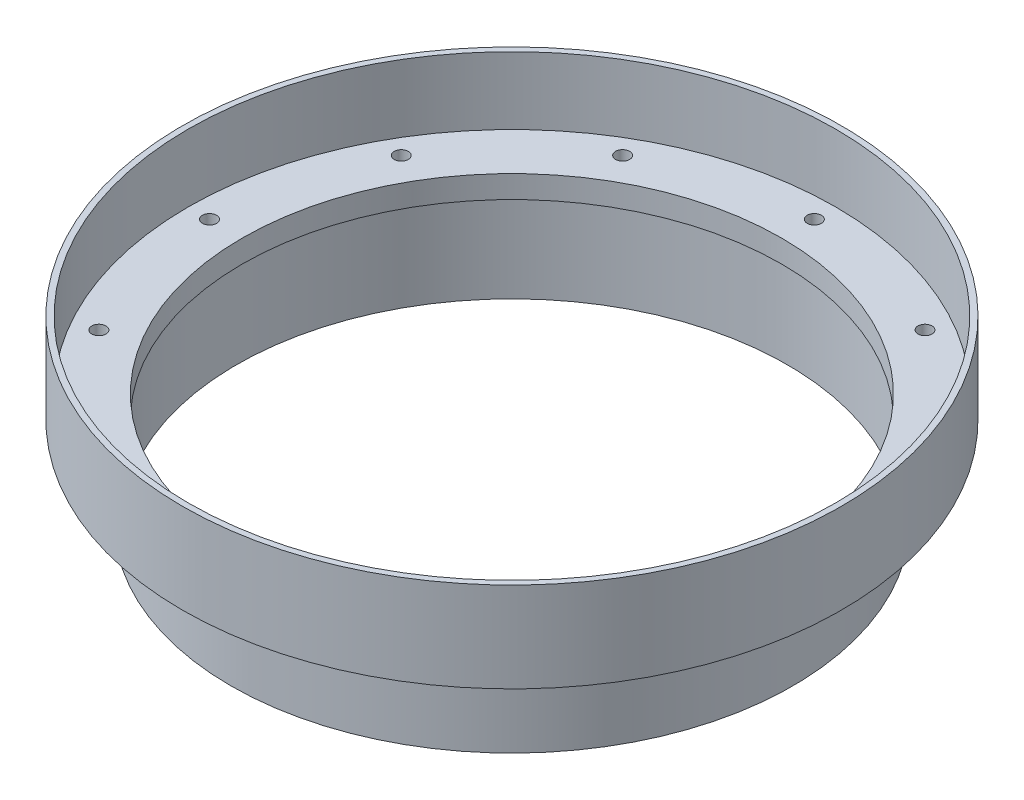
ISO-10303-21;
HEADER;
FILE_DESCRIPTION(('STEP AP214'),'2;1');
FILE_NAME('part.step','',(''),(''),'','','');
FILE_SCHEMA(('AUTOMOTIVE_DESIGN { 1 0 10303 214 1 1 1 1 }'));
ENDSEC;
DATA;
#1=APPLICATION_CONTEXT('core data for automotive mechanical design processes');
#2=APPLICATION_PROTOCOL_DEFINITION('international standard','automotive_design',2000,#1);
#3=PRODUCT_CONTEXT('',#1,'mechanical');
#4=PRODUCT('Part','Part','',(#3));
#5=PRODUCT_RELATED_PRODUCT_CATEGORY('part','',(#4));
#6=PRODUCT_DEFINITION_FORMATION('','',#4);
#7=PRODUCT_DEFINITION_CONTEXT('part definition',#1,'design');
#8=PRODUCT_DEFINITION('design','',#6,#7);
#9=PRODUCT_DEFINITION_SHAPE('','',#8);
#10=(LENGTH_UNIT() NAMED_UNIT(*) SI_UNIT(.MILLI.,.METRE.));
#11=(NAMED_UNIT(*) PLANE_ANGLE_UNIT() SI_UNIT($,.RADIAN.));
#12=(NAMED_UNIT(*) SI_UNIT($,.STERADIAN.) SOLID_ANGLE_UNIT());
#13=UNCERTAINTY_MEASURE_WITH_UNIT(LENGTH_MEASURE(1.E-05),#10,'distance_accuracy_value','');
#14=(GEOMETRIC_REPRESENTATION_CONTEXT(3) GLOBAL_UNCERTAINTY_ASSIGNED_CONTEXT((#13)) GLOBAL_UNIT_ASSIGNED_CONTEXT((#10,
#11,#12)) REPRESENTATION_CONTEXT('',''));
#15=CARTESIAN_POINT('',(0.,0.,0.));
#16=DIRECTION('',(0.,0.,1.));
#17=DIRECTION('',(1.,0.,0.));
#18=AXIS2_PLACEMENT_3D('',#15,#16,#17);
#19=CARTESIAN_POINT('',(-45.72,0.,0.));
#20=DIRECTION('',(0.,1.,0.));
#21=DIRECTION('',(0.,0.,1.));
#22=AXIS2_PLACEMENT_3D('',#19,#20,#21);
#23=PLANE('',#22);
#24=CARTESIAN_POINT('',(-36.9797827062029,0.,21.3502874999996));
#25=DIRECTION('',(0.,1.,0.));
#26=DIRECTION('',(0.,0.,1.));
#27=AXIS2_PLACEMENT_3D('',#24,#25,#26);
#28=CIRCLE('',#27,0.996949999999996);
#29=CARTESIAN_POINT('',(-36.9797827062029,0.,22.3472374999996));
#30=VERTEX_POINT('',#29);
#31=EDGE_CURVE('E168',#30,#30,#28,.T.);
#32=ORIENTED_EDGE('',*,*,#31,.F.);
#33=EDGE_LOOP('',(#32));
#34=FACE_BOUND('',#33,.T.);
#35=CARTESIAN_POINT('',(-21.3502875000004,0.,36.9797827062025));
#36=DIRECTION('',(0.,1.,0.));
#37=DIRECTION('',(0.,0.,1.));
#38=AXIS2_PLACEMENT_3D('',#35,#36,#37);
#39=CIRCLE('',#38,0.99695);
#40=CARTESIAN_POINT('',(-21.3502875000004,0.,37.9767327062025));
#41=VERTEX_POINT('',#40);
#42=EDGE_CURVE('E172',#41,#41,#39,.T.);
#43=ORIENTED_EDGE('',*,*,#42,.F.);
#44=EDGE_LOOP('',(#43));
#45=FACE_BOUND('',#44,.T.);
#46=CARTESIAN_POINT('',(-3.66184011613991E-13,0.,42.700575));
#47=DIRECTION('',(0.,1.,0.));
#48=DIRECTION('',(0.,0.,1.));
#49=AXIS2_PLACEMENT_3D('',#46,#47,#48);
#50=CIRCLE('',#49,0.996949999999999);
#51=CARTESIAN_POINT('',(-3.66184011613991E-13,0.,43.697525));
#52=VERTEX_POINT('',#51);
#53=EDGE_CURVE('E86',#52,#52,#50,.T.);
#54=ORIENTED_EDGE('',*,*,#53,.F.);
#55=EDGE_LOOP('',(#54));
#56=FACE_BOUND('',#55,.T.);
#57=CARTESIAN_POINT('',(21.3502874999997,0.,36.9797827062029));
#58=DIRECTION('',(0.,1.,0.));
#59=DIRECTION('',(0.,0.,1.));
#60=AXIS2_PLACEMENT_3D('',#57,#58,#59);
#61=CIRCLE('',#60,0.99695);
#62=CARTESIAN_POINT('',(21.3502874999997,0.,37.9767327062029));
#63=VERTEX_POINT('',#62);
#64=EDGE_CURVE('E74',#63,#63,#61,.T.);
#65=ORIENTED_EDGE('',*,*,#64,.F.);
#66=EDGE_LOOP('',(#65));
#67=FACE_BOUND('',#66,.T.);
#68=CARTESIAN_POINT('',(36.9797827062026,0.,21.3502875000002));
#69=DIRECTION('',(0.,1.,0.));
#70=DIRECTION('',(0.,0.,1.));
#71=AXIS2_PLACEMENT_3D('',#68,#69,#70);
#72=CIRCLE('',#71,0.996949999999996);
#73=CARTESIAN_POINT('',(36.9797827062026,0.,22.3472375000002));
#74=VERTEX_POINT('',#73);
#75=EDGE_CURVE('E73',#74,#74,#72,.T.);
#76=ORIENTED_EDGE('',*,*,#75,.F.);
#77=EDGE_LOOP('',(#76));
#78=FACE_BOUND('',#77,.T.);
#79=CARTESIAN_POINT('',(42.700575,0.,2.36058615455513E-13));
#80=DIRECTION('',(0.,1.,0.));
#81=DIRECTION('',(0.,0.,1.));
#82=AXIS2_PLACEMENT_3D('',#79,#80,#81);
#83=CIRCLE('',#82,0.996949999999996);
#84=CARTESIAN_POINT('',(42.700575,0.,0.996950000000233));
#85=VERTEX_POINT('',#84);
#86=EDGE_CURVE('E92',#85,#85,#83,.T.);
#87=ORIENTED_EDGE('',*,*,#86,.F.);
#88=EDGE_LOOP('',(#87));
#89=FACE_BOUND('',#88,.T.);
#90=CARTESIAN_POINT('',(36.9797827062028,0.,-21.3502874999998));
#91=DIRECTION('',(0.,1.,0.));
#92=DIRECTION('',(0.,0.,1.));
#93=AXIS2_PLACEMENT_3D('',#90,#91,#92);
#94=CIRCLE('',#93,0.996949999999996);
#95=CARTESIAN_POINT('',(36.9797827062028,0.,-20.3533374999998));
#96=VERTEX_POINT('',#95);
#97=EDGE_CURVE('E70',#96,#96,#94,.T.);
#98=ORIENTED_EDGE('',*,*,#97,.F.);
#99=EDGE_LOOP('',(#98));
#100=FACE_BOUND('',#99,.T.);
#101=CARTESIAN_POINT('',(21.3502875000001,0.,-36.9797827062026));
#102=DIRECTION('',(0.,1.,0.));
#103=DIRECTION('',(0.,0.,1.));
#104=AXIS2_PLACEMENT_3D('',#101,#102,#103);
#105=CIRCLE('',#104,0.99695);
#106=CARTESIAN_POINT('',(21.3502875000001,0.,-35.9828327062026));
#107=VERTEX_POINT('',#106);
#108=EDGE_CURVE('E69',#107,#107,#105,.T.);
#109=ORIENTED_EDGE('',*,*,#108,.F.);
#110=EDGE_LOOP('',(#109));
#111=FACE_BOUND('',#110,.T.);
#112=CARTESIAN_POINT('',(1.15414651602981E-13,0.,-42.700575));
#113=DIRECTION('',(0.,1.,0.));
#114=DIRECTION('',(0.,0.,1.));
#115=AXIS2_PLACEMENT_3D('',#112,#113,#114);
#116=CIRCLE('',#115,0.996949999999999);
#117=CARTESIAN_POINT('',(1.15414651602981E-13,0.,-41.703625));
#118=VERTEX_POINT('',#117);
#119=EDGE_CURVE('E105',#118,#118,#116,.T.);
#120=ORIENTED_EDGE('',*,*,#119,.F.);
#121=EDGE_LOOP('',(#120));
#122=FACE_BOUND('',#121,.T.);
#123=CARTESIAN_POINT('',(-21.3502874999999,0.,-36.9797827062027));
#124=DIRECTION('',(0.,1.,0.));
#125=DIRECTION('',(0.,0.,1.));
#126=AXIS2_PLACEMENT_3D('',#123,#124,#125);
#127=CIRCLE('',#126,0.99695);
#128=CARTESIAN_POINT('',(-21.3502874999999,0.,-35.9828327062027));
#129=VERTEX_POINT('',#128);
#130=EDGE_CURVE('E111',#129,#129,#127,.T.);
#131=ORIENTED_EDGE('',*,*,#130,.F.);
#132=EDGE_LOOP('',(#131));
#133=FACE_BOUND('',#132,.T.);
#134=CARTESIAN_POINT('',(-36.9797827062027,0.,-21.3502875));
#135=DIRECTION('',(0.,1.,0.));
#136=DIRECTION('',(0.,0.,1.));
#137=AXIS2_PLACEMENT_3D('',#134,#135,#136);
#138=CIRCLE('',#137,0.996949999999996);
#139=CARTESIAN_POINT('',(-36.9797827062027,0.,-20.3533375));
#140=VERTEX_POINT('',#139);
#141=EDGE_CURVE('E66',#140,#140,#138,.T.);
#142=ORIENTED_EDGE('',*,*,#141,.F.);
#143=EDGE_LOOP('',(#142));
#144=FACE_BOUND('',#143,.T.);
#145=CARTESIAN_POINT('',(-42.700575,0.,0.));
#146=DIRECTION('',(0.,1.,0.));
#147=DIRECTION('',(0.,0.,1.));
#148=AXIS2_PLACEMENT_3D('',#145,#146,#147);
#149=CIRCLE('',#148,0.996949999999996);
#150=CARTESIAN_POINT('',(-42.700575,0.,0.996950000000002));
#151=VERTEX_POINT('',#150);
#152=EDGE_CURVE('E65',#151,#151,#149,.T.);
#153=ORIENTED_EDGE('',*,*,#152,.F.);
#154=EDGE_LOOP('',(#153));
#155=FACE_BOUND('',#154,.T.);
#156=CARTESIAN_POINT('',(0.,0.,0.));
#157=DIRECTION('',(0.,1.,0.));
#158=DIRECTION('',(0.,0.,1.));
#159=AXIS2_PLACEMENT_3D('',#156,#157,#158);
#160=CIRCLE('',#159,45.72);
#161=CARTESIAN_POINT('',(0.,0.,45.72));
#162=VERTEX_POINT('',#161);
#163=EDGE_CURVE('E124',#162,#162,#160,.T.);
#164=ORIENTED_EDGE('',*,*,#163,.T.);
#165=EDGE_LOOP('',(#164));
#166=FACE_BOUND('',#165,.T.);
#167=CARTESIAN_POINT('',(0.,0.,0.));
#168=DIRECTION('',(0.,1.,0.));
#169=DIRECTION('',(0.,0.,1.));
#170=AXIS2_PLACEMENT_3D('',#167,#168,#169);
#171=CIRCLE('',#170,38.1);
#172=CARTESIAN_POINT('',(0.,0.,38.1));
#173=VERTEX_POINT('',#172);
#174=EDGE_CURVE('E12',#173,#173,#171,.T.);
#175=ORIENTED_EDGE('',*,*,#174,.F.);
#176=EDGE_LOOP('',(#175));
#177=FACE_BOUND('',#176,.T.);
#178=ADVANCED_FACE('F46',(#34,#45,#56,#67,#78,#89,#100,#111,#122,#133,#144,#155,#166,#177),#23,.T.);
#179=CARTESIAN_POINT('',(0.,55.,0.));
#180=DIRECTION('',(0.,1.,0.));
#181=DIRECTION('',(0.,0.,1.));
#182=AXIS2_PLACEMENT_3D('',#179,#180,#181);
#183=CYLINDRICAL_SURFACE('',#182,38.1);
#184=ORIENTED_EDGE('',*,*,#174,.T.);
#185=EDGE_LOOP('',(#184));
#186=FACE_BOUND('',#185,.T.);
#187=CARTESIAN_POINT('',(0.,-3.175,0.));
#188=DIRECTION('',(0.,1.,0.));
#189=DIRECTION('',(0.,0.,1.));
#190=AXIS2_PLACEMENT_3D('',#187,#188,#189);
#191=CIRCLE('',#190,38.1);
#192=CARTESIAN_POINT('',(0.,-3.175,38.1));
#193=VERTEX_POINT('',#192);
#194=EDGE_CURVE('E53',#193,#193,#191,.T.);
#195=ORIENTED_EDGE('',*,*,#194,.F.);
#196=EDGE_LOOP('',(#195));
#197=FACE_BOUND('',#196,.T.);
#198=ADVANCED_FACE('F152',(#186,#197),#183,.F.);
#199=CARTESIAN_POINT('',(-38.1,-3.175,0.));
#200=DIRECTION('',(0.,-1.,0.));
#201=DIRECTION('',(0.,0.,-1.));
#202=AXIS2_PLACEMENT_3D('',#199,#200,#201);
#203=PLANE('',#202);
#204=ORIENTED_EDGE('',*,*,#194,.T.);
#205=EDGE_LOOP('',(#204));
#206=FACE_BOUND('',#205,.T.);
#207=CARTESIAN_POINT('',(0.,-3.175,0.));
#208=DIRECTION('',(0.,1.,0.));
#209=DIRECTION('',(0.,0.,1.));
#210=AXIS2_PLACEMENT_3D('',#207,#208,#209);
#211=CIRCLE('',#210,38.8874);
#212=CARTESIAN_POINT('',(0.,-3.175,38.8874));
#213=VERTEX_POINT('',#212);
#214=EDGE_CURVE('E58',#213,#213,#211,.T.);
#215=ORIENTED_EDGE('',*,*,#214,.F.);
#216=EDGE_LOOP('',(#215));
#217=FACE_BOUND('',#216,.T.);
#218=ADVANCED_FACE('F150',(#206,#217),#203,.T.);
#219=CARTESIAN_POINT('',(0.,55.,0.));
#220=DIRECTION('',(0.,1.,0.));
#221=DIRECTION('',(0.,0.,1.));
#222=AXIS2_PLACEMENT_3D('',#219,#220,#221);
#223=CYLINDRICAL_SURFACE('',#222,38.8874);
#224=ORIENTED_EDGE('',*,*,#214,.T.);
#225=EDGE_LOOP('',(#224));
#226=FACE_BOUND('',#225,.T.);
#227=CARTESIAN_POINT('',(0.,-15.875,0.));
#228=DIRECTION('',(0.,1.,0.));
#229=DIRECTION('',(0.,0.,1.));
#230=AXIS2_PLACEMENT_3D('',#227,#228,#229);
#231=CIRCLE('',#230,38.8874);
#232=CARTESIAN_POINT('',(0.,-15.875,38.8874));
#233=VERTEX_POINT('',#232);
#234=EDGE_CURVE('E142',#233,#233,#231,.T.);
#235=ORIENTED_EDGE('',*,*,#234,.F.);
#236=EDGE_LOOP('',(#235));
#237=FACE_BOUND('',#236,.T.);
#238=ADVANCED_FACE('F147',(#226,#237),#223,.F.);
#239=CARTESIAN_POINT('',(-38.8874,-15.875,0.));
#240=DIRECTION('',(0.,-1.,0.));
#241=DIRECTION('',(0.,0.,-1.));
#242=AXIS2_PLACEMENT_3D('',#239,#240,#241);
#243=PLANE('',#242);
#244=ORIENTED_EDGE('',*,*,#234,.T.);
#245=EDGE_LOOP('',(#244));
#246=FACE_BOUND('',#245,.T.);
#247=CARTESIAN_POINT('',(0.,-15.875,0.));
#248=DIRECTION('',(0.,1.,0.));
#249=DIRECTION('',(0.,0.,1.));
#250=AXIS2_PLACEMENT_3D('',#247,#248,#249);
#251=CIRCLE('',#250,39.68115);
#252=CARTESIAN_POINT('',(0.,-15.875,39.68115));
#253=VERTEX_POINT('',#252);
#254=EDGE_CURVE('E139',#253,#253,#251,.T.);
#255=ORIENTED_EDGE('',*,*,#254,.F.);
#256=EDGE_LOOP('',(#255));
#257=FACE_BOUND('',#256,.T.);
#258=ADVANCED_FACE('F159',(#246,#257),#243,.T.);
#259=CARTESIAN_POINT('',(0.,55.,0.));
#260=DIRECTION('',(0.,1.,0.));
#261=DIRECTION('',(0.,0.,1.));
#262=AXIS2_PLACEMENT_3D('',#259,#260,#261);
#263=CYLINDRICAL_SURFACE('',#262,39.68115);
#264=ORIENTED_EDGE('',*,*,#254,.T.);
#265=EDGE_LOOP('',(#264));
#266=FACE_BOUND('',#265,.T.);
#267=CARTESIAN_POINT('',(0.,-3.175,0.));
#268=DIRECTION('',(0.,1.,0.));
#269=DIRECTION('',(0.,0.,1.));
#270=AXIS2_PLACEMENT_3D('',#267,#268,#269);
#271=CIRCLE('',#270,39.68115);
#272=CARTESIAN_POINT('',(0.,-3.175,39.68115));
#273=VERTEX_POINT('',#272);
#274=EDGE_CURVE('E136',#273,#273,#271,.T.);
#275=ORIENTED_EDGE('',*,*,#274,.F.);
#276=EDGE_LOOP('',(#275));
#277=FACE_BOUND('',#276,.T.);
#278=ADVANCED_FACE('F220',(#266,#277),#263,.T.);
#279=CARTESIAN_POINT('',(-39.68115,-3.175,0.));
#280=DIRECTION('',(0.,-1.,0.));
#281=DIRECTION('',(0.,0.,-1.));
#282=AXIS2_PLACEMENT_3D('',#279,#280,#281);
#283=PLANE('',#282);
#284=CARTESIAN_POINT('',(-36.9797827062029,-3.175,21.3502874999996));
#285=DIRECTION('',(0.,-1.,0.));
#286=DIRECTION('',(0.,0.,-1.));
#287=AXIS2_PLACEMENT_3D('',#284,#285,#286);
#288=CIRCLE('',#287,0.996949999999996);
#289=CARTESIAN_POINT('',(-36.9797827062029,-3.175,20.3533374999996));
#290=VERTEX_POINT('',#289);
#291=EDGE_CURVE('E49',#290,#290,#288,.T.);
#292=ORIENTED_EDGE('',*,*,#291,.F.);
#293=EDGE_LOOP('',(#292));
#294=FACE_BOUND('',#293,.T.);
#295=CARTESIAN_POINT('',(-21.3502875000004,-3.175,36.9797827062025));
#296=DIRECTION('',(0.,-1.,0.));
#297=DIRECTION('',(0.,0.,-1.));
#298=AXIS2_PLACEMENT_3D('',#295,#296,#297);
#299=CIRCLE('',#298,0.99695);
#300=CARTESIAN_POINT('',(-21.3502875000004,-3.175,35.9828327062025));
#301=VERTEX_POINT('',#300);
#302=EDGE_CURVE('E436',#301,#301,#299,.T.);
#303=ORIENTED_EDGE('',*,*,#302,.F.);
#304=EDGE_LOOP('',(#303));
#305=FACE_BOUND('',#304,.T.);
#306=CARTESIAN_POINT('',(-3.66184011613991E-13,-3.175,42.700575));
#307=DIRECTION('',(0.,-1.,0.));
#308=DIRECTION('',(0.,0.,-1.));
#309=AXIS2_PLACEMENT_3D('',#306,#307,#308);
#310=CIRCLE('',#309,0.996949999999999);
#311=CARTESIAN_POINT('',(-3.66184011613991E-13,-3.175,41.703625));
#312=VERTEX_POINT('',#311);
#313=EDGE_CURVE('E81',#312,#312,#310,.T.);
#314=ORIENTED_EDGE('',*,*,#313,.F.);
#315=EDGE_LOOP('',(#314));
#316=FACE_BOUND('',#315,.T.);
#317=CARTESIAN_POINT('',(21.3502874999997,-3.175,36.9797827062029));
#318=DIRECTION('',(0.,-1.,0.));
#319=DIRECTION('',(0.,0.,-1.));
#320=AXIS2_PLACEMENT_3D('',#317,#318,#319);
#321=CIRCLE('',#320,0.99695);
#322=CARTESIAN_POINT('',(21.3502874999997,-3.175,35.9828327062029));
#323=VERTEX_POINT('',#322);
#324=EDGE_CURVE('E71',#323,#323,#321,.T.);
#325=ORIENTED_EDGE('',*,*,#324,.F.);
#326=EDGE_LOOP('',(#325));
#327=FACE_BOUND('',#326,.T.);
#328=CARTESIAN_POINT('',(36.9797827062026,-3.175,21.3502875000002));
#329=DIRECTION('',(0.,-1.,0.));
#330=DIRECTION('',(0.,0.,-1.));
#331=AXIS2_PLACEMENT_3D('',#328,#329,#330);
#332=CIRCLE('',#331,0.996949999999996);
#333=CARTESIAN_POINT('',(36.9797827062026,-3.175,20.3533375000002));
#334=VERTEX_POINT('',#333);
#335=EDGE_CURVE('E78',#334,#334,#332,.T.);
#336=ORIENTED_EDGE('',*,*,#335,.F.);
#337=EDGE_LOOP('',(#336));
#338=FACE_BOUND('',#337,.T.);
#339=CARTESIAN_POINT('',(42.700575,-3.175,2.36058615455513E-13));
#340=DIRECTION('',(0.,-1.,0.));
#341=DIRECTION('',(0.,0.,-1.));
#342=AXIS2_PLACEMENT_3D('',#339,#340,#341);
#343=CIRCLE('',#342,0.996949999999996);
#344=CARTESIAN_POINT('',(42.700575,-3.175,-0.99694999999976));
#345=VERTEX_POINT('',#344);
#346=EDGE_CURVE('E95',#345,#345,#343,.T.);
#347=ORIENTED_EDGE('',*,*,#346,.F.);
#348=EDGE_LOOP('',(#347));
#349=FACE_BOUND('',#348,.T.);
#350=CARTESIAN_POINT('',(36.9797827062028,-3.175,-21.3502874999998));
#351=DIRECTION('',(0.,-1.,0.));
#352=DIRECTION('',(0.,0.,-1.));
#353=AXIS2_PLACEMENT_3D('',#350,#351,#352);
#354=CIRCLE('',#353,0.996949999999996);
#355=CARTESIAN_POINT('',(36.9797827062028,-3.175,-22.3472374999998));
#356=VERTEX_POINT('',#355);
#357=EDGE_CURVE('E67',#356,#356,#354,.T.);
#358=ORIENTED_EDGE('',*,*,#357,.F.);
#359=EDGE_LOOP('',(#358));
#360=FACE_BOUND('',#359,.T.);
#361=CARTESIAN_POINT('',(21.3502875000001,-3.175,-36.9797827062026));
#362=DIRECTION('',(0.,-1.,0.));
#363=DIRECTION('',(0.,0.,-1.));
#364=AXIS2_PLACEMENT_3D('',#361,#362,#363);
#365=CIRCLE('',#364,0.99695);
#366=CARTESIAN_POINT('',(21.3502875000001,-3.175,-37.9767327062026));
#367=VERTEX_POINT('',#366);
#368=EDGE_CURVE('E102',#367,#367,#365,.T.);
#369=ORIENTED_EDGE('',*,*,#368,.F.);
#370=EDGE_LOOP('',(#369));
#371=FACE_BOUND('',#370,.T.);
#372=CARTESIAN_POINT('',(1.15414651602981E-13,-3.175,-42.700575));
#373=DIRECTION('',(0.,-1.,0.));
#374=DIRECTION('',(0.,0.,-1.));
#375=AXIS2_PLACEMENT_3D('',#372,#373,#374);
#376=CIRCLE('',#375,0.996949999999999);
#377=CARTESIAN_POINT('',(1.15414651602981E-13,-3.175,-43.697525));
#378=VERTEX_POINT('',#377);
#379=EDGE_CURVE('E108',#378,#378,#376,.T.);
#380=ORIENTED_EDGE('',*,*,#379,.F.);
#381=EDGE_LOOP('',(#380));
#382=FACE_BOUND('',#381,.T.);
#383=CARTESIAN_POINT('',(-21.3502874999999,-3.175,-36.9797827062027));
#384=DIRECTION('',(0.,-1.,0.));
#385=DIRECTION('',(0.,0.,-1.));
#386=AXIS2_PLACEMENT_3D('',#383,#384,#385);
#387=CIRCLE('',#386,0.99695);
#388=CARTESIAN_POINT('',(-21.3502874999999,-3.175,-37.9767327062027));
#389=VERTEX_POINT('',#388);
#390=EDGE_CURVE('E114',#389,#389,#387,.T.);
#391=ORIENTED_EDGE('',*,*,#390,.F.);
#392=EDGE_LOOP('',(#391));
#393=FACE_BOUND('',#392,.T.);
#394=CARTESIAN_POINT('',(-36.9797827062027,-3.175,-21.3502875));
#395=DIRECTION('',(0.,-1.,0.));
#396=DIRECTION('',(0.,0.,-1.));
#397=AXIS2_PLACEMENT_3D('',#394,#395,#396);
#398=CIRCLE('',#397,0.996949999999996);
#399=CARTESIAN_POINT('',(-36.9797827062027,-3.175,-22.3472375));
#400=VERTEX_POINT('',#399);
#401=EDGE_CURVE('E62',#400,#400,#398,.T.);
#402=ORIENTED_EDGE('',*,*,#401,.F.);
#403=EDGE_LOOP('',(#402));
#404=FACE_BOUND('',#403,.T.);
#405=CARTESIAN_POINT('',(-42.700575,-3.175,0.));
#406=DIRECTION('',(0.,-1.,0.));
#407=DIRECTION('',(0.,0.,-1.));
#408=AXIS2_PLACEMENT_3D('',#405,#406,#407);
#409=CIRCLE('',#408,0.996949999999996);
#410=CARTESIAN_POINT('',(-42.700575,-3.175,-0.996949999999991));
#411=VERTEX_POINT('',#410);
#412=EDGE_CURVE('E121',#411,#411,#409,.T.);
#413=ORIENTED_EDGE('',*,*,#412,.F.);
#414=EDGE_LOOP('',(#413));
#415=FACE_BOUND('',#414,.T.);
#416=ORIENTED_EDGE('',*,*,#274,.T.);
#417=EDGE_LOOP('',(#416));
#418=FACE_BOUND('',#417,.T.);
#419=CARTESIAN_POINT('',(0.,-3.175,0.));
#420=DIRECTION('',(0.,1.,0.));
#421=DIRECTION('',(0.,0.,1.));
#422=AXIS2_PLACEMENT_3D('',#419,#420,#421);
#423=CIRCLE('',#422,46.53915);
#424=CARTESIAN_POINT('',(0.,-3.175,46.53915));
#425=VERTEX_POINT('',#424);
#426=EDGE_CURVE('E133',#425,#425,#423,.T.);
#427=ORIENTED_EDGE('',*,*,#426,.F.);
#428=EDGE_LOOP('',(#427));
#429=FACE_BOUND('',#428,.T.);
#430=ADVANCED_FACE('F216',(#294,#305,#316,#327,#338,#349,#360,#371,#382,#393,#404,#415,#418,
#429),#283,.T.);
#431=CARTESIAN_POINT('',(0.,55.,0.));
#432=DIRECTION('',(0.,1.,0.));
#433=DIRECTION('',(0.,0.,1.));
#434=AXIS2_PLACEMENT_3D('',#431,#432,#433);
#435=CYLINDRICAL_SURFACE('',#434,46.53915);
#436=ORIENTED_EDGE('',*,*,#426,.T.);
#437=EDGE_LOOP('',(#436));
#438=FACE_BOUND('',#437,.T.);
#439=CARTESIAN_POINT('',(0.,9.525,0.));
#440=DIRECTION('',(0.,1.,0.));
#441=DIRECTION('',(0.,0.,1.));
#442=AXIS2_PLACEMENT_3D('',#439,#440,#441);
#443=CIRCLE('',#442,46.53915);
#444=CARTESIAN_POINT('',(0.,9.525,46.53915));
#445=VERTEX_POINT('',#444);
#446=EDGE_CURVE('E130',#445,#445,#443,.T.);
#447=ORIENTED_EDGE('',*,*,#446,.F.);
#448=EDGE_LOOP('',(#447));
#449=FACE_BOUND('',#448,.T.);
#450=ADVANCED_FACE('F209',(#438,#449),#435,.T.);
#451=CARTESIAN_POINT('',(-46.53915,9.525,0.));
#452=DIRECTION('',(0.,1.,0.));
#453=DIRECTION('',(0.,0.,1.));
#454=AXIS2_PLACEMENT_3D('',#451,#452,#453);
#455=PLANE('',#454);
#456=ORIENTED_EDGE('',*,*,#446,.T.);
#457=EDGE_LOOP('',(#456));
#458=FACE_BOUND('',#457,.T.);
#459=CARTESIAN_POINT('',(0.,9.525,0.));
#460=DIRECTION('',(0.,1.,0.));
#461=DIRECTION('',(0.,0.,1.));
#462=AXIS2_PLACEMENT_3D('',#459,#460,#461);
#463=CIRCLE('',#462,45.72);
#464=CARTESIAN_POINT('',(0.,9.525,45.72));
#465=VERTEX_POINT('',#464);
#466=EDGE_CURVE('E127',#465,#465,#463,.T.);
#467=ORIENTED_EDGE('',*,*,#466,.F.);
#468=EDGE_LOOP('',(#467));
#469=FACE_BOUND('',#468,.T.);
#470=ADVANCED_FACE('F199',(#458,#469),#455,.T.);
#471=CARTESIAN_POINT('',(0.,55.,0.));
#472=DIRECTION('',(0.,1.,0.));
#473=DIRECTION('',(0.,0.,1.));
#474=AXIS2_PLACEMENT_3D('',#471,#472,#473);
#475=CYLINDRICAL_SURFACE('',#474,45.72);
#476=ORIENTED_EDGE('',*,*,#466,.T.);
#477=EDGE_LOOP('',(#476));
#478=FACE_BOUND('',#477,.T.);
#479=ORIENTED_EDGE('',*,*,#163,.F.);
#480=EDGE_LOOP('',(#479));
#481=FACE_BOUND('',#480,.T.);
#482=ADVANCED_FACE('F196',(#478,#481),#475,.F.);
#483=CARTESIAN_POINT('',(-42.700575,0.,0.));
#484=DIRECTION('',(0.,1.,0.));
#485=DIRECTION('',(0.,0.,1.));
#486=AXIS2_PLACEMENT_3D('',#483,#484,#485);
#487=CYLINDRICAL_SURFACE('',#486,0.996949999999996);
#488=ORIENTED_EDGE('',*,*,#412,.T.);
#489=EDGE_LOOP('',(#488));
#490=FACE_BOUND('',#489,.T.);
#491=ORIENTED_EDGE('',*,*,#152,.T.);
#492=EDGE_LOOP('',(#491));
#493=FACE_BOUND('',#492,.T.);
#494=ADVANCED_FACE('F198',(#490,#493),#487,.F.);
#495=CARTESIAN_POINT('',(-36.9797827062027,0.,-21.3502875));
#496=DIRECTION('',(0.,1.,0.));
#497=DIRECTION('',(0.,0.,1.));
#498=AXIS2_PLACEMENT_3D('',#495,#496,#497);
#499=CYLINDRICAL_SURFACE('',#498,0.996949999999996);
#500=ORIENTED_EDGE('',*,*,#401,.T.);
#501=EDGE_LOOP('',(#500));
#502=FACE_BOUND('',#501,.T.);
#503=ORIENTED_EDGE('',*,*,#141,.T.);
#504=EDGE_LOOP('',(#503));
#505=FACE_BOUND('',#504,.T.);
#506=ADVANCED_FACE('F206',(#502,#505),#499,.F.);
#507=CARTESIAN_POINT('',(-21.3502874999999,0.,-36.9797827062027));
#508=DIRECTION('',(0.,1.,0.));
#509=DIRECTION('',(0.,0.,1.));
#510=AXIS2_PLACEMENT_3D('',#507,#508,#509);
#511=CYLINDRICAL_SURFACE('',#510,0.99695);
#512=ORIENTED_EDGE('',*,*,#390,.T.);
#513=EDGE_LOOP('',(#512));
#514=FACE_BOUND('',#513,.T.);
#515=ORIENTED_EDGE('',*,*,#130,.T.);
#516=EDGE_LOOP('',(#515));
#517=FACE_BOUND('',#516,.T.);
#518=ADVANCED_FACE('F321',(#514,#517),#511,.F.);
#519=CARTESIAN_POINT('',(1.15414651602981E-13,0.,-42.700575));
#520=DIRECTION('',(0.,1.,0.));
#521=DIRECTION('',(0.,0.,1.));
#522=AXIS2_PLACEMENT_3D('',#519,#520,#521);
#523=CYLINDRICAL_SURFACE('',#522,0.996949999999999);
#524=ORIENTED_EDGE('',*,*,#379,.T.);
#525=EDGE_LOOP('',(#524));
#526=FACE_BOUND('',#525,.T.);
#527=ORIENTED_EDGE('',*,*,#119,.T.);
#528=EDGE_LOOP('',(#527));
#529=FACE_BOUND('',#528,.T.);
#530=ADVANCED_FACE('F326',(#526,#529),#523,.F.);
#531=CARTESIAN_POINT('',(21.3502875000001,0.,-36.9797827062026));
#532=DIRECTION('',(0.,1.,0.));
#533=DIRECTION('',(0.,0.,1.));
#534=AXIS2_PLACEMENT_3D('',#531,#532,#533);
#535=CYLINDRICAL_SURFACE('',#534,0.99695);
#536=ORIENTED_EDGE('',*,*,#368,.T.);
#537=EDGE_LOOP('',(#536));
#538=FACE_BOUND('',#537,.T.);
#539=ORIENTED_EDGE('',*,*,#108,.T.);
#540=EDGE_LOOP('',(#539));
#541=FACE_BOUND('',#540,.T.);
#542=ADVANCED_FACE('F311',(#538,#541),#535,.F.);
#543=CARTESIAN_POINT('',(36.9797827062028,0.,-21.3502874999998));
#544=DIRECTION('',(0.,1.,0.));
#545=DIRECTION('',(0.,0.,1.));
#546=AXIS2_PLACEMENT_3D('',#543,#544,#545);
#547=CYLINDRICAL_SURFACE('',#546,0.996949999999996);
#548=ORIENTED_EDGE('',*,*,#357,.T.);
#549=EDGE_LOOP('',(#548));
#550=FACE_BOUND('',#549,.T.);
#551=ORIENTED_EDGE('',*,*,#97,.T.);
#552=EDGE_LOOP('',(#551));
#553=FACE_BOUND('',#552,.T.);
#554=ADVANCED_FACE('F305',(#550,#553),#547,.F.);
#555=CARTESIAN_POINT('',(42.700575,0.,2.36058615455513E-13));
#556=DIRECTION('',(0.,1.,0.));
#557=DIRECTION('',(0.,0.,1.));
#558=AXIS2_PLACEMENT_3D('',#555,#556,#557);
#559=CYLINDRICAL_SURFACE('',#558,0.996949999999996);
#560=ORIENTED_EDGE('',*,*,#346,.T.);
#561=EDGE_LOOP('',(#560));
#562=FACE_BOUND('',#561,.T.);
#563=ORIENTED_EDGE('',*,*,#86,.T.);
#564=EDGE_LOOP('',(#563));
#565=FACE_BOUND('',#564,.T.);
#566=ADVANCED_FACE('F310',(#562,#565),#559,.F.);
#567=CARTESIAN_POINT('',(36.9797827062026,0.,21.3502875000002));
#568=DIRECTION('',(0.,1.,0.));
#569=DIRECTION('',(0.,0.,1.));
#570=AXIS2_PLACEMENT_3D('',#567,#568,#569);
#571=CYLINDRICAL_SURFACE('',#570,0.996949999999996);
#572=ORIENTED_EDGE('',*,*,#335,.T.);
#573=EDGE_LOOP('',(#572));
#574=FACE_BOUND('',#573,.T.);
#575=ORIENTED_EDGE('',*,*,#75,.T.);
#576=EDGE_LOOP('',(#575));
#577=FACE_BOUND('',#576,.T.);
#578=ADVANCED_FACE('F352',(#574,#577),#571,.F.);
#579=CARTESIAN_POINT('',(21.3502874999997,0.,36.9797827062029));
#580=DIRECTION('',(0.,1.,0.));
#581=DIRECTION('',(0.,0.,1.));
#582=AXIS2_PLACEMENT_3D('',#579,#580,#581);
#583=CYLINDRICAL_SURFACE('',#582,0.99695);
#584=ORIENTED_EDGE('',*,*,#324,.T.);
#585=EDGE_LOOP('',(#584));
#586=FACE_BOUND('',#585,.T.);
#587=ORIENTED_EDGE('',*,*,#64,.T.);
#588=EDGE_LOOP('',(#587));
#589=FACE_BOUND('',#588,.T.);
#590=ADVANCED_FACE('F340',(#586,#589),#583,.F.);
#591=CARTESIAN_POINT('',(-3.66184011613991E-13,0.,42.700575));
#592=DIRECTION('',(0.,1.,0.));
#593=DIRECTION('',(0.,0.,1.));
#594=AXIS2_PLACEMENT_3D('',#591,#592,#593);
#595=CYLINDRICAL_SURFACE('',#594,0.996949999999999);
#596=ORIENTED_EDGE('',*,*,#313,.T.);
#597=EDGE_LOOP('',(#596));
#598=FACE_BOUND('',#597,.T.);
#599=ORIENTED_EDGE('',*,*,#53,.T.);
#600=EDGE_LOOP('',(#599));
#601=FACE_BOUND('',#600,.T.);
#602=ADVANCED_FACE('F334',(#598,#601),#595,.F.);
#603=CARTESIAN_POINT('',(-21.3502875000004,0.,36.9797827062025));
#604=DIRECTION('',(0.,1.,0.));
#605=DIRECTION('',(0.,0.,1.));
#606=AXIS2_PLACEMENT_3D('',#603,#604,#605);
#607=CYLINDRICAL_SURFACE('',#606,0.99695);
#608=ORIENTED_EDGE('',*,*,#302,.T.);
#609=EDGE_LOOP('',(#608));
#610=FACE_BOUND('',#609,.T.);
#611=ORIENTED_EDGE('',*,*,#42,.T.);
#612=EDGE_LOOP('',(#611));
#613=FACE_BOUND('',#612,.T.);
#614=ADVANCED_FACE('F339',(#610,#613),#607,.F.);
#615=CARTESIAN_POINT('',(-36.9797827062029,0.,21.3502874999996));
#616=DIRECTION('',(0.,1.,0.));
#617=DIRECTION('',(0.,0.,1.));
#618=AXIS2_PLACEMENT_3D('',#615,#616,#617);
#619=CYLINDRICAL_SURFACE('',#618,0.996949999999996);
#620=ORIENTED_EDGE('',*,*,#291,.T.);
#621=EDGE_LOOP('',(#620));
#622=FACE_BOUND('',#621,.T.);
#623=ORIENTED_EDGE('',*,*,#31,.T.);
#624=EDGE_LOOP('',(#623));
#625=FACE_BOUND('',#624,.T.);
#626=ADVANCED_FACE('F369',(#622,#625),#619,.F.);
#627=CLOSED_SHELL('',(#178,#198,#218,#238,#258,#278,#430,#450,#470,#482,#494,#506,#518,#530,
#542,#554,#566,#578,#590,#602,#614,#626));
#628=MANIFOLD_SOLID_BREP('B2',#627);
#629=ADVANCED_BREP_SHAPE_REPRESENTATION('',(#18,#628),#14);
#630=SHAPE_DEFINITION_REPRESENTATION(#9,#629);
ENDSEC;
END-ISO-10303-21;
